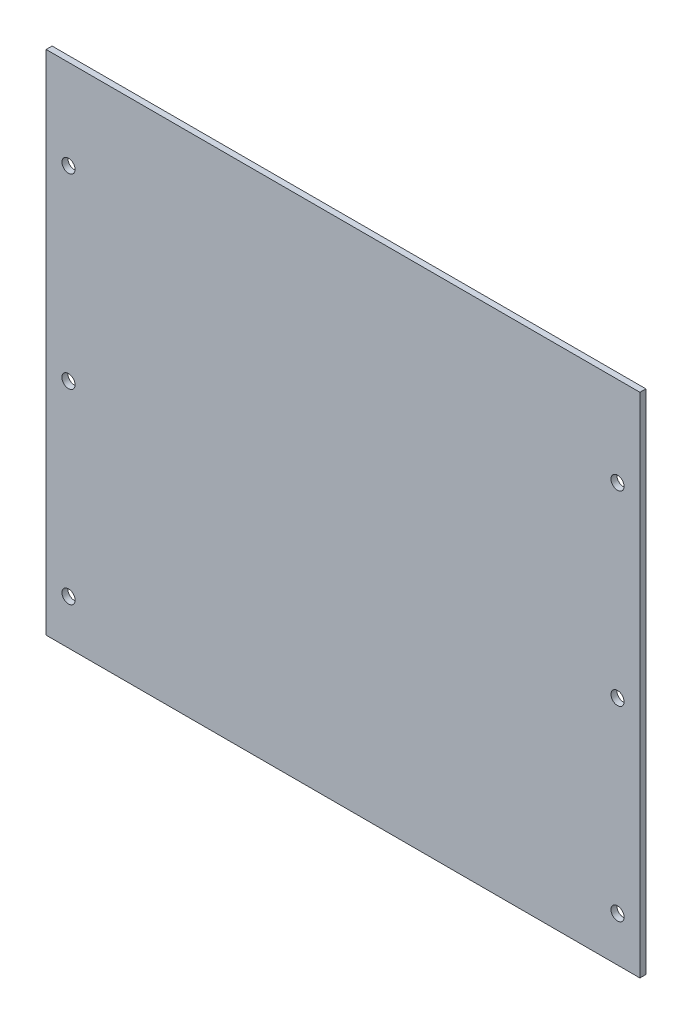
ISO-10303-21;
HEADER;
FILE_DESCRIPTION(('STEP AP214'),'2;1');
FILE_NAME('part.step','',(''),(''),'','','');
FILE_SCHEMA(('AUTOMOTIVE_DESIGN { 1 0 10303 214 1 1 1 1 }'));
ENDSEC;
DATA;
#1=APPLICATION_CONTEXT('core data for automotive mechanical design processes');
#2=APPLICATION_PROTOCOL_DEFINITION('international standard','automotive_design',2000,#1);
#3=PRODUCT_CONTEXT('',#1,'mechanical');
#4=PRODUCT('Part','Part','',(#3));
#5=PRODUCT_RELATED_PRODUCT_CATEGORY('part','',(#4));
#6=PRODUCT_DEFINITION_FORMATION('','',#4);
#7=PRODUCT_DEFINITION_CONTEXT('part definition',#1,'design');
#8=PRODUCT_DEFINITION('design','',#6,#7);
#9=PRODUCT_DEFINITION_SHAPE('','',#8);
#10=(LENGTH_UNIT() NAMED_UNIT(*) SI_UNIT(.MILLI.,.METRE.));
#11=(NAMED_UNIT(*) PLANE_ANGLE_UNIT() SI_UNIT($,.RADIAN.));
#12=(NAMED_UNIT(*) SI_UNIT($,.STERADIAN.) SOLID_ANGLE_UNIT());
#13=UNCERTAINTY_MEASURE_WITH_UNIT(LENGTH_MEASURE(1.E-05),#10,'distance_accuracy_value','');
#14=(GEOMETRIC_REPRESENTATION_CONTEXT(3) GLOBAL_UNCERTAINTY_ASSIGNED_CONTEXT((#13)) GLOBAL_UNIT_ASSIGNED_CONTEXT((#10,
#11,#12)) REPRESENTATION_CONTEXT('',''));
#15=CARTESIAN_POINT('',(0.,0.,0.));
#16=DIRECTION('',(0.,0.,1.));
#17=DIRECTION('',(1.,0.,0.));
#18=AXIS2_PLACEMENT_3D('',#15,#16,#17);
#19=CARTESIAN_POINT('',(99.5,85.,2.));
#20=DIRECTION('',(-1.,0.,0.));
#21=DIRECTION('',(0.,-1.,0.));
#22=AXIS2_PLACEMENT_3D('',#19,#20,#21);
#23=PLANE('',#22);
#24=DIRECTION('',(0.,1.,0.));
#25=VECTOR('',#24,1.);
#26=CARTESIAN_POINT('',(99.5,85.,0.));
#27=LINE('',#26,#25);
#28=CARTESIAN_POINT('',(99.5,-85.,0.));
#29=VERTEX_POINT('',#28);
#30=CARTESIAN_POINT('',(99.5,85.,0.));
#31=VERTEX_POINT('',#30);
#32=EDGE_CURVE('E96',#29,#31,#27,.T.);
#33=ORIENTED_EDGE('',*,*,#32,.T.);
#34=DIRECTION('',(0.,0.,-1.));
#35=VECTOR('',#34,1.);
#36=CARTESIAN_POINT('',(99.5,85.,2.));
#37=LINE('',#36,#35);
#38=CARTESIAN_POINT('',(99.5,85.,2.));
#39=VERTEX_POINT('',#38);
#40=EDGE_CURVE('E11',#39,#31,#37,.T.);
#41=ORIENTED_EDGE('',*,*,#40,.F.);
#42=DIRECTION('',(0.,1.,0.));
#43=VECTOR('',#42,1.);
#44=CARTESIAN_POINT('',(99.5,85.,2.));
#45=LINE('',#44,#43);
#46=CARTESIAN_POINT('',(99.5,-85.,2.));
#47=VERTEX_POINT('',#46);
#48=EDGE_CURVE('E84',#47,#39,#45,.T.);
#49=ORIENTED_EDGE('',*,*,#48,.F.);
#50=DIRECTION('',(0.,0.,-1.));
#51=VECTOR('',#50,1.);
#52=CARTESIAN_POINT('',(99.5,-85.,2.));
#53=LINE('',#52,#51);
#54=EDGE_CURVE('E92',#47,#29,#53,.T.);
#55=ORIENTED_EDGE('',*,*,#54,.T.);
#56=EDGE_LOOP('',(#33,#41,#49,#55));
#57=FACE_BOUND('',#56,.T.);
#58=ADVANCED_FACE('F33',(#57),#23,.F.);
#59=CARTESIAN_POINT('',(-99.5,85.,2.));
#60=DIRECTION('',(0.,-1.,0.));
#61=DIRECTION('',(0.,0.,-1.));
#62=AXIS2_PLACEMENT_3D('',#59,#60,#61);
#63=PLANE('',#62);
#64=DIRECTION('',(-1.,0.,0.));
#65=VECTOR('',#64,1.);
#66=CARTESIAN_POINT('',(-99.5,85.,0.));
#67=LINE('',#66,#65);
#68=CARTESIAN_POINT('',(-99.5,85.,0.));
#69=VERTEX_POINT('',#68);
#70=EDGE_CURVE('E88',#31,#69,#67,.T.);
#71=ORIENTED_EDGE('',*,*,#70,.T.);
#72=DIRECTION('',(0.,0.,-1.));
#73=VECTOR('',#72,1.);
#74=CARTESIAN_POINT('',(-99.5,85.,2.));
#75=LINE('',#74,#73);
#76=CARTESIAN_POINT('',(-99.5,85.,2.));
#77=VERTEX_POINT('',#76);
#78=EDGE_CURVE('E41',#77,#69,#75,.T.);
#79=ORIENTED_EDGE('',*,*,#78,.F.);
#80=DIRECTION('',(-1.,0.,0.));
#81=VECTOR('',#80,1.);
#82=CARTESIAN_POINT('',(-99.5,85.,2.));
#83=LINE('',#82,#81);
#84=EDGE_CURVE('E79',#39,#77,#83,.T.);
#85=ORIENTED_EDGE('',*,*,#84,.F.);
#86=ORIENTED_EDGE('',*,*,#40,.T.);
#87=EDGE_LOOP('',(#71,#79,#85,#86));
#88=FACE_BOUND('',#87,.T.);
#89=ADVANCED_FACE('F87',(#88),#63,.F.);
#90=CARTESIAN_POINT('',(-99.5,85.,2.));
#91=DIRECTION('',(1.,0.,0.));
#92=DIRECTION('',(0.,1.,0.));
#93=AXIS2_PLACEMENT_3D('',#90,#91,#92);
#94=PLANE('',#93);
#95=DIRECTION('',(0.,-1.,0.));
#96=VECTOR('',#95,1.);
#97=CARTESIAN_POINT('',(-99.5,85.,0.));
#98=LINE('',#97,#96);
#99=CARTESIAN_POINT('',(-99.5,-85.,0.));
#100=VERTEX_POINT('',#99);
#101=EDGE_CURVE('E66',#69,#100,#98,.T.);
#102=ORIENTED_EDGE('',*,*,#101,.T.);
#103=DIRECTION('',(0.,0.,-1.));
#104=VECTOR('',#103,1.);
#105=CARTESIAN_POINT('',(-99.5,-85.,2.));
#106=LINE('',#105,#104);
#107=CARTESIAN_POINT('',(-99.5,-85.,2.));
#108=VERTEX_POINT('',#107);
#109=EDGE_CURVE('E89',#108,#100,#106,.T.);
#110=ORIENTED_EDGE('',*,*,#109,.F.);
#111=DIRECTION('',(0.,-1.,0.));
#112=VECTOR('',#111,1.);
#113=CARTESIAN_POINT('',(-99.5,85.,2.));
#114=LINE('',#113,#112);
#115=EDGE_CURVE('E82',#77,#108,#114,.T.);
#116=ORIENTED_EDGE('',*,*,#115,.F.);
#117=ORIENTED_EDGE('',*,*,#78,.T.);
#118=EDGE_LOOP('',(#102,#110,#116,#117));
#119=FACE_BOUND('',#118,.T.);
#120=ADVANCED_FACE('F90',(#119),#94,.F.);
#121=CARTESIAN_POINT('',(-99.5,-85.,2.));
#122=DIRECTION('',(0.,1.,0.));
#123=DIRECTION('',(0.,0.,1.));
#124=AXIS2_PLACEMENT_3D('',#121,#122,#123);
#125=PLANE('',#124);
#126=DIRECTION('',(1.,0.,0.));
#127=VECTOR('',#126,1.);
#128=CARTESIAN_POINT('',(-99.5,-85.,0.));
#129=LINE('',#128,#127);
#130=EDGE_CURVE('E72',#100,#29,#129,.T.);
#131=ORIENTED_EDGE('',*,*,#130,.T.);
#132=ORIENTED_EDGE('',*,*,#54,.F.);
#133=DIRECTION('',(1.,0.,0.));
#134=VECTOR('',#133,1.);
#135=CARTESIAN_POINT('',(-99.5,-85.,2.));
#136=LINE('',#135,#134);
#137=EDGE_CURVE('E49',#108,#47,#136,.T.);
#138=ORIENTED_EDGE('',*,*,#137,.F.);
#139=ORIENTED_EDGE('',*,*,#109,.T.);
#140=EDGE_LOOP('',(#131,#132,#138,#139));
#141=FACE_BOUND('',#140,.T.);
#142=ADVANCED_FACE('F104',(#141),#125,.F.);
#143=CARTESIAN_POINT('',(0.,0.,2.));
#144=DIRECTION('',(0.,0.,1.));
#145=DIRECTION('',(1.,0.,0.));
#146=AXIS2_PLACEMENT_3D('',#143,#144,#145);
#147=PLANE('',#146);
#148=CARTESIAN_POINT('',(-92.,-7.49999999999999,2.));
#149=DIRECTION('',(0.,0.,1.));
#150=DIRECTION('',(1.,0.,0.));
#151=AXIS2_PLACEMENT_3D('',#148,#149,#150);
#152=CIRCLE('',#151,2.20000000000001);
#153=CARTESIAN_POINT('',(-89.8,-7.49999999999999,2.));
#154=VERTEX_POINT('',#153);
#155=EDGE_CURVE('E113',#154,#154,#152,.T.);
#156=ORIENTED_EDGE('',*,*,#155,.F.);
#157=EDGE_LOOP('',(#156));
#158=FACE_BOUND('',#157,.T.);
#159=CARTESIAN_POINT('',(-92.,-70.,2.));
#160=DIRECTION('',(0.,0.,1.));
#161=DIRECTION('',(1.,0.,0.));
#162=AXIS2_PLACEMENT_3D('',#159,#160,#161);
#163=CIRCLE('',#162,2.2);
#164=CARTESIAN_POINT('',(-89.8,-70.,2.));
#165=VERTEX_POINT('',#164);
#166=EDGE_CURVE('E132',#165,#165,#163,.T.);
#167=ORIENTED_EDGE('',*,*,#166,.F.);
#168=EDGE_LOOP('',(#167));
#169=FACE_BOUND('',#168,.T.);
#170=CARTESIAN_POINT('',(92.,55.,2.));
#171=DIRECTION('',(0.,0.,1.));
#172=DIRECTION('',(1.,0.,0.));
#173=AXIS2_PLACEMENT_3D('',#170,#171,#172);
#174=CIRCLE('',#173,2.20000000000001);
#175=CARTESIAN_POINT('',(94.2,55.,2.));
#176=VERTEX_POINT('',#175);
#177=EDGE_CURVE('E126',#176,#176,#174,.T.);
#178=ORIENTED_EDGE('',*,*,#177,.F.);
#179=EDGE_LOOP('',(#178));
#180=FACE_BOUND('',#179,.T.);
#181=CARTESIAN_POINT('',(92.,-7.49999999999999,2.));
#182=DIRECTION('',(0.,0.,1.));
#183=DIRECTION('',(1.,0.,0.));
#184=AXIS2_PLACEMENT_3D('',#181,#182,#183);
#185=CIRCLE('',#184,2.2);
#186=CARTESIAN_POINT('',(94.2,-7.49999999999999,2.));
#187=VERTEX_POINT('',#186);
#188=EDGE_CURVE('E119',#187,#187,#185,.T.);
#189=ORIENTED_EDGE('',*,*,#188,.F.);
#190=EDGE_LOOP('',(#189));
#191=FACE_BOUND('',#190,.T.);
#192=CARTESIAN_POINT('',(92.,-70.,2.));
#193=DIRECTION('',(0.,0.,1.));
#194=DIRECTION('',(1.,0.,0.));
#195=AXIS2_PLACEMENT_3D('',#192,#193,#194);
#196=CIRCLE('',#195,2.2);
#197=CARTESIAN_POINT('',(94.2,-70.,2.));
#198=VERTEX_POINT('',#197);
#199=EDGE_CURVE('E120',#198,#198,#196,.T.);
#200=ORIENTED_EDGE('',*,*,#199,.F.);
#201=EDGE_LOOP('',(#200));
#202=FACE_BOUND('',#201,.T.);
#203=CARTESIAN_POINT('',(-92.,55.,2.));
#204=DIRECTION('',(0.,0.,1.));
#205=DIRECTION('',(1.,0.,0.));
#206=AXIS2_PLACEMENT_3D('',#203,#204,#205);
#207=CIRCLE('',#206,2.2);
#208=CARTESIAN_POINT('',(-89.8,55.,2.));
#209=VERTEX_POINT('',#208);
#210=EDGE_CURVE('E110',#209,#209,#207,.T.);
#211=ORIENTED_EDGE('',*,*,#210,.F.);
#212=EDGE_LOOP('',(#211));
#213=FACE_BOUND('',#212,.T.);
#214=ORIENTED_EDGE('',*,*,#48,.T.);
#215=ORIENTED_EDGE('',*,*,#84,.T.);
#216=ORIENTED_EDGE('',*,*,#115,.T.);
#217=ORIENTED_EDGE('',*,*,#137,.T.);
#218=EDGE_LOOP('',(#214,#215,#216,#217));
#219=FACE_BOUND('',#218,.T.);
#220=ADVANCED_FACE('F80',(#158,#169,#180,#191,#202,#213,#219),#147,.T.);
#221=CARTESIAN_POINT('',(0.,0.,0.));
#222=DIRECTION('',(0.,0.,1.));
#223=DIRECTION('',(1.,0.,0.));
#224=AXIS2_PLACEMENT_3D('',#221,#222,#223);
#225=PLANE('',#224);
#226=CARTESIAN_POINT('',(-92.,-7.49999999999999,0.));
#227=DIRECTION('',(0.,0.,1.));
#228=DIRECTION('',(1.,0.,0.));
#229=AXIS2_PLACEMENT_3D('',#226,#227,#228);
#230=CIRCLE('',#229,2.20000000000001);
#231=CARTESIAN_POINT('',(-89.8,-7.49999999999999,0.));
#232=VERTEX_POINT('',#231);
#233=EDGE_CURVE('E135',#232,#232,#230,.T.);
#234=ORIENTED_EDGE('',*,*,#233,.T.);
#235=EDGE_LOOP('',(#234));
#236=FACE_BOUND('',#235,.T.);
#237=CARTESIAN_POINT('',(-92.,-70.,0.));
#238=DIRECTION('',(0.,0.,1.));
#239=DIRECTION('',(1.,0.,0.));
#240=AXIS2_PLACEMENT_3D('',#237,#238,#239);
#241=CIRCLE('',#240,2.2);
#242=CARTESIAN_POINT('',(-89.8,-70.,0.));
#243=VERTEX_POINT('',#242);
#244=EDGE_CURVE('E129',#243,#243,#241,.T.);
#245=ORIENTED_EDGE('',*,*,#244,.T.);
#246=EDGE_LOOP('',(#245));
#247=FACE_BOUND('',#246,.T.);
#248=CARTESIAN_POINT('',(92.,55.,0.));
#249=DIRECTION('',(0.,0.,1.));
#250=DIRECTION('',(1.,0.,0.));
#251=AXIS2_PLACEMENT_3D('',#248,#249,#250);
#252=CIRCLE('',#251,2.20000000000001);
#253=CARTESIAN_POINT('',(94.2,55.,0.));
#254=VERTEX_POINT('',#253);
#255=EDGE_CURVE('E123',#254,#254,#252,.T.);
#256=ORIENTED_EDGE('',*,*,#255,.T.);
#257=EDGE_LOOP('',(#256));
#258=FACE_BOUND('',#257,.T.);
#259=CARTESIAN_POINT('',(92.,-7.49999999999999,0.));
#260=DIRECTION('',(0.,0.,1.));
#261=DIRECTION('',(1.,0.,0.));
#262=AXIS2_PLACEMENT_3D('',#259,#260,#261);
#263=CIRCLE('',#262,2.2);
#264=CARTESIAN_POINT('',(94.2,-7.49999999999999,0.));
#265=VERTEX_POINT('',#264);
#266=EDGE_CURVE('E116',#265,#265,#263,.T.);
#267=ORIENTED_EDGE('',*,*,#266,.T.);
#268=EDGE_LOOP('',(#267));
#269=FACE_BOUND('',#268,.T.);
#270=CARTESIAN_POINT('',(92.,-70.,0.));
#271=DIRECTION('',(0.,0.,1.));
#272=DIRECTION('',(1.,0.,0.));
#273=AXIS2_PLACEMENT_3D('',#270,#271,#272);
#274=CIRCLE('',#273,2.2);
#275=CARTESIAN_POINT('',(94.2,-70.,0.));
#276=VERTEX_POINT('',#275);
#277=EDGE_CURVE('E140',#276,#276,#274,.T.);
#278=ORIENTED_EDGE('',*,*,#277,.T.);
#279=EDGE_LOOP('',(#278));
#280=FACE_BOUND('',#279,.T.);
#281=CARTESIAN_POINT('',(-92.,55.,0.));
#282=DIRECTION('',(0.,0.,1.));
#283=DIRECTION('',(1.,0.,0.));
#284=AXIS2_PLACEMENT_3D('',#281,#282,#283);
#285=CIRCLE('',#284,2.2);
#286=CARTESIAN_POINT('',(-89.8,55.,0.));
#287=VERTEX_POINT('',#286);
#288=EDGE_CURVE('E99',#287,#287,#285,.T.);
#289=ORIENTED_EDGE('',*,*,#288,.T.);
#290=EDGE_LOOP('',(#289));
#291=FACE_BOUND('',#290,.T.);
#292=ORIENTED_EDGE('',*,*,#32,.F.);
#293=ORIENTED_EDGE('',*,*,#130,.F.);
#294=ORIENTED_EDGE('',*,*,#101,.F.);
#295=ORIENTED_EDGE('',*,*,#70,.F.);
#296=EDGE_LOOP('',(#292,#293,#294,#295));
#297=FACE_BOUND('',#296,.T.);
#298=ADVANCED_FACE('F107',(#236,#247,#258,#269,#280,#291,#297),#225,.F.);
#299=CARTESIAN_POINT('',(-92.,55.,0.));
#300=DIRECTION('',(0.,0.,1.));
#301=DIRECTION('',(1.,0.,0.));
#302=AXIS2_PLACEMENT_3D('',#299,#300,#301);
#303=CYLINDRICAL_SURFACE('',#302,2.2);
#304=ORIENTED_EDGE('',*,*,#288,.F.);
#305=EDGE_LOOP('',(#304));
#306=FACE_BOUND('',#305,.T.);
#307=ORIENTED_EDGE('',*,*,#210,.T.);
#308=EDGE_LOOP('',(#307));
#309=FACE_BOUND('',#308,.T.);
#310=ADVANCED_FACE('F154',(#306,#309),#303,.F.);
#311=CARTESIAN_POINT('',(92.,-70.,0.));
#312=DIRECTION('',(0.,0.,1.));
#313=DIRECTION('',(1.,0.,0.));
#314=AXIS2_PLACEMENT_3D('',#311,#312,#313);
#315=CYLINDRICAL_SURFACE('',#314,2.2);
#316=ORIENTED_EDGE('',*,*,#277,.F.);
#317=EDGE_LOOP('',(#316));
#318=FACE_BOUND('',#317,.T.);
#319=ORIENTED_EDGE('',*,*,#199,.T.);
#320=EDGE_LOOP('',(#319));
#321=FACE_BOUND('',#320,.T.);
#322=ADVANCED_FACE('F146',(#318,#321),#315,.F.);
#323=CARTESIAN_POINT('',(92.,-7.49999999999999,0.));
#324=DIRECTION('',(0.,0.,1.));
#325=DIRECTION('',(1.,0.,0.));
#326=AXIS2_PLACEMENT_3D('',#323,#324,#325);
#327=CYLINDRICAL_SURFACE('',#326,2.2);
#328=ORIENTED_EDGE('',*,*,#266,.F.);
#329=EDGE_LOOP('',(#328));
#330=FACE_BOUND('',#329,.T.);
#331=ORIENTED_EDGE('',*,*,#188,.T.);
#332=EDGE_LOOP('',(#331));
#333=FACE_BOUND('',#332,.T.);
#334=ADVANCED_FACE('F162',(#330,#333),#327,.F.);
#335=CARTESIAN_POINT('',(92.,55.,0.));
#336=DIRECTION('',(0.,0.,1.));
#337=DIRECTION('',(1.,0.,0.));
#338=AXIS2_PLACEMENT_3D('',#335,#336,#337);
#339=CYLINDRICAL_SURFACE('',#338,2.20000000000001);
#340=ORIENTED_EDGE('',*,*,#255,.F.);
#341=EDGE_LOOP('',(#340));
#342=FACE_BOUND('',#341,.T.);
#343=ORIENTED_EDGE('',*,*,#177,.T.);
#344=EDGE_LOOP('',(#343));
#345=FACE_BOUND('',#344,.T.);
#346=ADVANCED_FACE('F210',(#342,#345),#339,.F.);
#347=CARTESIAN_POINT('',(-92.,-70.,0.));
#348=DIRECTION('',(0.,0.,1.));
#349=DIRECTION('',(1.,0.,0.));
#350=AXIS2_PLACEMENT_3D('',#347,#348,#349);
#351=CYLINDRICAL_SURFACE('',#350,2.2);
#352=ORIENTED_EDGE('',*,*,#244,.F.);
#353=EDGE_LOOP('',(#352));
#354=FACE_BOUND('',#353,.T.);
#355=ORIENTED_EDGE('',*,*,#166,.T.);
#356=EDGE_LOOP('',(#355));
#357=FACE_BOUND('',#356,.T.);
#358=ADVANCED_FACE('F219',(#354,#357),#351,.F.);
#359=CARTESIAN_POINT('',(-92.,-7.49999999999999,0.));
#360=DIRECTION('',(0.,0.,1.));
#361=DIRECTION('',(1.,0.,0.));
#362=AXIS2_PLACEMENT_3D('',#359,#360,#361);
#363=CYLINDRICAL_SURFACE('',#362,2.20000000000001);
#364=ORIENTED_EDGE('',*,*,#233,.F.);
#365=EDGE_LOOP('',(#364));
#366=FACE_BOUND('',#365,.T.);
#367=ORIENTED_EDGE('',*,*,#155,.T.);
#368=EDGE_LOOP('',(#367));
#369=FACE_BOUND('',#368,.T.);
#370=ADVANCED_FACE('F229',(#366,#369),#363,.F.);
#371=CLOSED_SHELL('',(#58,#89,#120,#142,#220,#298,#310,#322,#334,#346,#358,#370));
#372=MANIFOLD_SOLID_BREP('B2',#371);
#373=ADVANCED_BREP_SHAPE_REPRESENTATION('',(#18,#372),#14);
#374=SHAPE_DEFINITION_REPRESENTATION(#9,#373);
ENDSEC;
END-ISO-10303-21;
